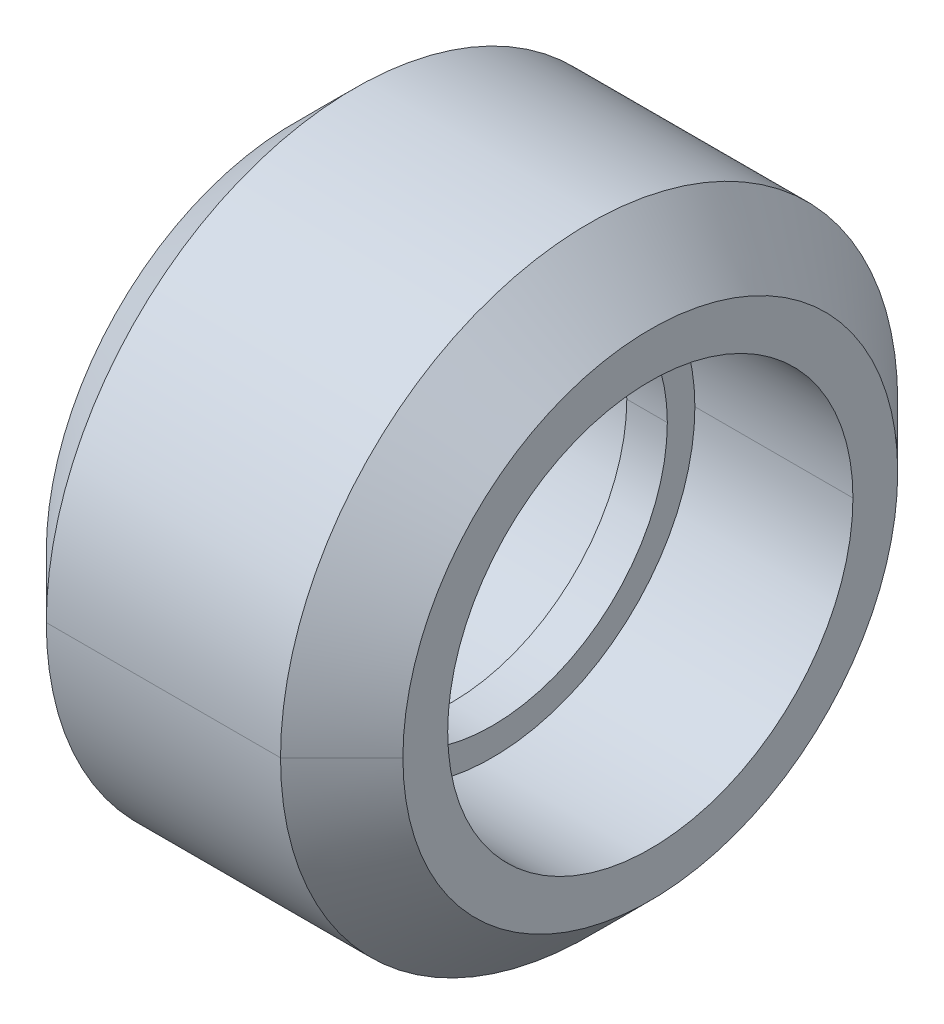
ISO-10303-21;
HEADER;
FILE_DESCRIPTION(('STEP AP214'),'2;1');
FILE_NAME('part.step','',(''),(''),'','','');
FILE_SCHEMA(('AUTOMOTIVE_DESIGN { 1 0 10303 214 1 1 1 1 }'));
ENDSEC;
DATA;
#1=APPLICATION_CONTEXT('core data for automotive mechanical design processes');
#2=APPLICATION_PROTOCOL_DEFINITION('international standard','automotive_design',2000,#1);
#3=PRODUCT_CONTEXT('',#1,'mechanical');
#4=PRODUCT('Part','Part','',(#3));
#5=PRODUCT_RELATED_PRODUCT_CATEGORY('part','',(#4));
#6=PRODUCT_DEFINITION_FORMATION('','',#4);
#7=PRODUCT_DEFINITION_CONTEXT('part definition',#1,'design');
#8=PRODUCT_DEFINITION('design','',#6,#7);
#9=PRODUCT_DEFINITION_SHAPE('','',#8);
#10=(LENGTH_UNIT() NAMED_UNIT(*) SI_UNIT(.MILLI.,.METRE.));
#11=(NAMED_UNIT(*) PLANE_ANGLE_UNIT() SI_UNIT($,.RADIAN.));
#12=(NAMED_UNIT(*) SI_UNIT($,.STERADIAN.) SOLID_ANGLE_UNIT());
#13=UNCERTAINTY_MEASURE_WITH_UNIT(LENGTH_MEASURE(1.E-05),#10,'distance_accuracy_value','');
#14=(GEOMETRIC_REPRESENTATION_CONTEXT(3) GLOBAL_UNCERTAINTY_ASSIGNED_CONTEXT((#13)) GLOBAL_UNIT_ASSIGNED_CONTEXT((#10,
#11,#12)) REPRESENTATION_CONTEXT('',''));
#15=CARTESIAN_POINT('',(0.,0.,0.));
#16=DIRECTION('',(0.,0.,1.));
#17=DIRECTION('',(1.,0.,0.));
#18=AXIS2_PLACEMENT_3D('',#15,#16,#17);
#19=CARTESIAN_POINT('',(0.,0.,0.));
#20=DIRECTION('',(1.,0.,0.));
#21=DIRECTION('',(0.,0.,-1.));
#22=AXIS2_PLACEMENT_3D('',#19,#20,#21);
#23=CYLINDRICAL_SURFACE('',#22,5.);
#24=DIRECTION('',(1.,0.,0.));
#25=VECTOR('',#24,1.);
#26=CARTESIAN_POINT('',(0.,0.,5.));
#27=LINE('',#26,#25);
#28=CARTESIAN_POINT('',(-4.4,0.,5.));
#29=VERTEX_POINT('',#28);
#30=CARTESIAN_POINT('',(-0.5,0.,5.));
#31=VERTEX_POINT('',#30);
#32=EDGE_CURVE('E21',#29,#31,#27,.T.);
#33=ORIENTED_EDGE('',*,*,#32,.F.);
#34=CARTESIAN_POINT('',(-4.4,0.,0.));
#35=DIRECTION('',(1.,0.,0.));
#36=DIRECTION('',(0.,0.,-1.));
#37=AXIS2_PLACEMENT_3D('',#34,#35,#36);
#38=CIRCLE('',#37,5.);
#39=CARTESIAN_POINT('',(-4.4,0.,-5.));
#40=VERTEX_POINT('',#39);
#41=EDGE_CURVE('E11',#40,#29,#38,.T.);
#42=ORIENTED_EDGE('',*,*,#41,.F.);
#43=DIRECTION('',(1.,0.,0.));
#44=VECTOR('',#43,1.);
#45=CARTESIAN_POINT('',(0.,0.,-5.));
#46=LINE('',#45,#44);
#47=CARTESIAN_POINT('',(-0.5,0.,-5.));
#48=VERTEX_POINT('',#47);
#49=EDGE_CURVE('E132',#40,#48,#46,.T.);
#50=ORIENTED_EDGE('',*,*,#49,.T.);
#51=CARTESIAN_POINT('',(-0.5,0.,0.));
#52=DIRECTION('',(1.,0.,0.));
#53=DIRECTION('',(0.,0.,-1.));
#54=AXIS2_PLACEMENT_3D('',#51,#52,#53);
#55=CIRCLE('',#54,5.);
#56=EDGE_CURVE('E125',#48,#31,#55,.T.);
#57=ORIENTED_EDGE('',*,*,#56,.T.);
#58=EDGE_LOOP('',(#33,#42,#50,#57));
#59=FACE_BOUND('',#58,.T.);
#60=ADVANCED_FACE('F17',(#59),#23,.F.);
#61=CARTESIAN_POINT('',(-4.4,5.,0.));
#62=DIRECTION('',(-1.,0.,0.));
#63=DIRECTION('',(0.,0.,1.));
#64=AXIS2_PLACEMENT_3D('',#61,#62,#63);
#65=PLANE('',#64);
#66=ORIENTED_EDGE('',*,*,#41,.T.);
#67=CARTESIAN_POINT('',(-4.4,0.,0.));
#68=DIRECTION('',(1.,0.,0.));
#69=DIRECTION('',(0.,0.,-1.));
#70=AXIS2_PLACEMENT_3D('',#67,#68,#69);
#71=CIRCLE('',#70,5.);
#72=EDGE_CURVE('E120',#29,#40,#71,.T.);
#73=ORIENTED_EDGE('',*,*,#72,.T.);
#74=EDGE_LOOP('',(#66,#73));
#75=FACE_BOUND('',#74,.T.);
#76=CARTESIAN_POINT('',(-4.4,0.,0.));
#77=DIRECTION('',(1.,0.,0.));
#78=DIRECTION('',(0.,0.,-1.));
#79=AXIS2_PLACEMENT_3D('',#76,#77,#78);
#80=CIRCLE('',#79,6.105);
#81=CARTESIAN_POINT('',(-4.4,0.,-6.105));
#82=VERTEX_POINT('',#81);
#83=CARTESIAN_POINT('',(-4.4,0.,6.105));
#84=VERTEX_POINT('',#83);
#85=EDGE_CURVE('E151',#82,#84,#80,.T.);
#86=ORIENTED_EDGE('',*,*,#85,.F.);
#87=CARTESIAN_POINT('',(-4.4,0.,0.));
#88=DIRECTION('',(1.,0.,0.));
#89=DIRECTION('',(0.,0.,-1.));
#90=AXIS2_PLACEMENT_3D('',#87,#88,#89);
#91=CIRCLE('',#90,6.105);
#92=EDGE_CURVE('E28',#84,#82,#91,.T.);
#93=ORIENTED_EDGE('',*,*,#92,.F.);
#94=EDGE_LOOP('',(#86,#93));
#95=FACE_BOUND('',#94,.T.);
#96=ADVANCED_FACE('F117',(#75,#95),#65,.T.);
#97=CARTESIAN_POINT('',(-2.89,0.,0.));
#98=DIRECTION('',(1.,0.,0.));
#99=DIRECTION('',(0.,0.,-1.));
#100=AXIS2_PLACEMENT_3D('',#97,#98,#99);
#101=CONICAL_SURFACE('',#100,7.615,0.785398163397447);
#102=DIRECTION('',(0.707106781186549,0.,0.707106781186546));
#103=VECTOR('',#102,1.);
#104=CARTESIAN_POINT('',(-2.89,0.,7.615));
#105=LINE('',#104,#103);
#106=CARTESIAN_POINT('',(-2.89,0.,7.615));
#107=VERTEX_POINT('',#106);
#108=EDGE_CURVE('E146',#84,#107,#105,.T.);
#109=ORIENTED_EDGE('',*,*,#108,.F.);
#110=ORIENTED_EDGE('',*,*,#92,.T.);
#111=DIRECTION('',(0.707106781186549,0.,-0.707106781186546));
#112=VECTOR('',#111,1.);
#113=CARTESIAN_POINT('',(-2.89,0.,-7.615));
#114=LINE('',#113,#112);
#115=CARTESIAN_POINT('',(-2.89,0.,-7.615));
#116=VERTEX_POINT('',#115);
#117=EDGE_CURVE('E233',#82,#116,#114,.T.);
#118=ORIENTED_EDGE('',*,*,#117,.T.);
#119=CARTESIAN_POINT('',(-2.89,0.,0.));
#120=DIRECTION('',(1.,0.,0.));
#121=DIRECTION('',(0.,0.,-1.));
#122=AXIS2_PLACEMENT_3D('',#119,#120,#121);
#123=CIRCLE('',#122,7.615);
#124=EDGE_CURVE('E172',#107,#116,#123,.T.);
#125=ORIENTED_EDGE('',*,*,#124,.F.);
#126=EDGE_LOOP('',(#109,#110,#118,#125));
#127=FACE_BOUND('',#126,.T.);
#128=ADVANCED_FACE('F254',(#127),#101,.T.);
#129=CARTESIAN_POINT('',(0.,0.,0.));
#130=DIRECTION('',(1.,0.,0.));
#131=DIRECTION('',(0.,0.,-1.));
#132=AXIS2_PLACEMENT_3D('',#129,#130,#131);
#133=CYLINDRICAL_SURFACE('',#132,7.615);
#134=DIRECTION('',(1.,0.,0.));
#135=VECTOR('',#134,1.);
#136=CARTESIAN_POINT('',(0.,0.,7.615));
#137=LINE('',#136,#135);
#138=CARTESIAN_POINT('',(2.89,0.,7.615));
#139=VERTEX_POINT('',#138);
#140=EDGE_CURVE('E157',#107,#139,#137,.T.);
#141=ORIENTED_EDGE('',*,*,#140,.F.);
#142=ORIENTED_EDGE('',*,*,#124,.T.);
#143=DIRECTION('',(1.,0.,0.));
#144=VECTOR('',#143,1.);
#145=CARTESIAN_POINT('',(0.,0.,-7.615));
#146=LINE('',#145,#144);
#147=CARTESIAN_POINT('',(2.89,0.,-7.615));
#148=VERTEX_POINT('',#147);
#149=EDGE_CURVE('E156',#116,#148,#146,.T.);
#150=ORIENTED_EDGE('',*,*,#149,.T.);
#151=CARTESIAN_POINT('',(2.89,0.,0.));
#152=DIRECTION('',(1.,0.,0.));
#153=DIRECTION('',(0.,0.,-1.));
#154=AXIS2_PLACEMENT_3D('',#151,#152,#153);
#155=CIRCLE('',#154,7.615);
#156=EDGE_CURVE('E161',#139,#148,#155,.T.);
#157=ORIENTED_EDGE('',*,*,#156,.F.);
#158=EDGE_LOOP('',(#141,#142,#150,#157));
#159=FACE_BOUND('',#158,.T.);
#160=ADVANCED_FACE('F264',(#159),#133,.T.);
#161=CARTESIAN_POINT('',(4.4,0.,0.));
#162=DIRECTION('',(-1.,0.,0.));
#163=DIRECTION('',(0.,0.,1.));
#164=AXIS2_PLACEMENT_3D('',#161,#162,#163);
#165=CONICAL_SURFACE('',#164,6.105,0.785398163397447);
#166=DIRECTION('',(-0.707106781186549,0.,-0.707106781186546));
#167=VECTOR('',#166,1.);
#168=CARTESIAN_POINT('',(4.4,0.,-6.105));
#169=LINE('',#168,#167);
#170=CARTESIAN_POINT('',(4.4,0.,-6.105));
#171=VERTEX_POINT('',#170);
#172=EDGE_CURVE('E182',#171,#148,#169,.T.);
#173=ORIENTED_EDGE('',*,*,#172,.F.);
#174=CARTESIAN_POINT('',(4.4,0.,0.));
#175=DIRECTION('',(1.,0.,0.));
#176=DIRECTION('',(0.,0.,-1.));
#177=AXIS2_PLACEMENT_3D('',#174,#175,#176);
#178=CIRCLE('',#177,6.105);
#179=CARTESIAN_POINT('',(4.4,0.,6.105));
#180=VERTEX_POINT('',#179);
#181=EDGE_CURVE('E158',#180,#171,#178,.T.);
#182=ORIENTED_EDGE('',*,*,#181,.F.);
#183=DIRECTION('',(-0.707106781186549,0.,0.707106781186546));
#184=VECTOR('',#183,1.);
#185=CARTESIAN_POINT('',(4.4,0.,6.105));
#186=LINE('',#185,#184);
#187=EDGE_CURVE('E181',#180,#139,#186,.T.);
#188=ORIENTED_EDGE('',*,*,#187,.T.);
#189=ORIENTED_EDGE('',*,*,#156,.T.);
#190=EDGE_LOOP('',(#173,#182,#188,#189));
#191=FACE_BOUND('',#190,.T.);
#192=ADVANCED_FACE('F268',(#191),#165,.T.);
#193=CARTESIAN_POINT('',(4.4,5.,0.));
#194=DIRECTION('',(1.,0.,0.));
#195=DIRECTION('',(0.,1.,0.));
#196=AXIS2_PLACEMENT_3D('',#193,#194,#195);
#197=PLANE('',#196);
#198=CARTESIAN_POINT('',(4.4,0.,0.));
#199=DIRECTION('',(1.,0.,0.));
#200=DIRECTION('',(0.,0.,-1.));
#201=AXIS2_PLACEMENT_3D('',#198,#199,#200);
#202=CIRCLE('',#201,5.);
#203=CARTESIAN_POINT('',(4.4,0.,-5.));
#204=VERTEX_POINT('',#203);
#205=CARTESIAN_POINT('',(4.4,0.,5.));
#206=VERTEX_POINT('',#205);
#207=EDGE_CURVE('E162',#204,#206,#202,.T.);
#208=ORIENTED_EDGE('',*,*,#207,.F.);
#209=CARTESIAN_POINT('',(4.4,0.,0.));
#210=DIRECTION('',(1.,0.,0.));
#211=DIRECTION('',(0.,0.,-1.));
#212=AXIS2_PLACEMENT_3D('',#209,#210,#211);
#213=CIRCLE('',#212,5.);
#214=EDGE_CURVE('E145',#206,#204,#213,.T.);
#215=ORIENTED_EDGE('',*,*,#214,.F.);
#216=EDGE_LOOP('',(#208,#215));
#217=FACE_BOUND('',#216,.T.);
#218=ORIENTED_EDGE('',*,*,#181,.T.);
#219=CARTESIAN_POINT('',(4.4,0.,0.));
#220=DIRECTION('',(1.,0.,0.));
#221=DIRECTION('',(0.,0.,-1.));
#222=AXIS2_PLACEMENT_3D('',#219,#220,#221);
#223=CIRCLE('',#222,6.105);
#224=EDGE_CURVE('E171',#171,#180,#223,.T.);
#225=ORIENTED_EDGE('',*,*,#224,.T.);
#226=EDGE_LOOP('',(#218,#225));
#227=FACE_BOUND('',#226,.T.);
#228=ADVANCED_FACE('F273',(#217,#227),#197,.T.);
#229=CARTESIAN_POINT('',(0.,0.,0.));
#230=DIRECTION('',(1.,0.,0.));
#231=DIRECTION('',(0.,0.,-1.));
#232=AXIS2_PLACEMENT_3D('',#229,#230,#231);
#233=CYLINDRICAL_SURFACE('',#232,5.);
#234=DIRECTION('',(1.,0.,0.));
#235=VECTOR('',#234,1.);
#236=CARTESIAN_POINT('',(0.,0.,5.));
#237=LINE('',#236,#235);
#238=CARTESIAN_POINT('',(0.5,0.,5.));
#239=VERTEX_POINT('',#238);
#240=EDGE_CURVE('E180',#239,#206,#237,.T.);
#241=ORIENTED_EDGE('',*,*,#240,.F.);
#242=CARTESIAN_POINT('',(0.5,0.,0.));
#243=DIRECTION('',(1.,0.,0.));
#244=DIRECTION('',(0.,0.,-1.));
#245=AXIS2_PLACEMENT_3D('',#242,#243,#244);
#246=CIRCLE('',#245,5.);
#247=CARTESIAN_POINT('',(0.5,0.,-5.));
#248=VERTEX_POINT('',#247);
#249=EDGE_CURVE('E186',#248,#239,#246,.T.);
#250=ORIENTED_EDGE('',*,*,#249,.F.);
#251=DIRECTION('',(1.,0.,0.));
#252=VECTOR('',#251,1.);
#253=CARTESIAN_POINT('',(0.,0.,-5.));
#254=LINE('',#253,#252);
#255=EDGE_CURVE('E140',#248,#204,#254,.T.);
#256=ORIENTED_EDGE('',*,*,#255,.T.);
#257=ORIENTED_EDGE('',*,*,#207,.T.);
#258=EDGE_LOOP('',(#241,#250,#256,#257));
#259=FACE_BOUND('',#258,.T.);
#260=ADVANCED_FACE('F275',(#259),#233,.F.);
#261=CARTESIAN_POINT('',(0.5,4.32,0.));
#262=DIRECTION('',(1.,0.,0.));
#263=DIRECTION('',(0.,1.,0.));
#264=AXIS2_PLACEMENT_3D('',#261,#262,#263);
#265=PLANE('',#264);
#266=CARTESIAN_POINT('',(0.5,0.,0.));
#267=DIRECTION('',(1.,0.,0.));
#268=DIRECTION('',(0.,0.,-1.));
#269=AXIS2_PLACEMENT_3D('',#266,#267,#268);
#270=CIRCLE('',#269,4.32);
#271=CARTESIAN_POINT('',(0.5,0.,-4.32));
#272=VERTEX_POINT('',#271);
#273=CARTESIAN_POINT('',(0.5,0.,4.32));
#274=VERTEX_POINT('',#273);
#275=EDGE_CURVE('E42',#272,#274,#270,.T.);
#276=ORIENTED_EDGE('',*,*,#275,.F.);
#277=CARTESIAN_POINT('',(0.5,0.,0.));
#278=DIRECTION('',(1.,0.,0.));
#279=DIRECTION('',(0.,0.,-1.));
#280=AXIS2_PLACEMENT_3D('',#277,#278,#279);
#281=CIRCLE('',#280,4.32);
#282=EDGE_CURVE('E195',#274,#272,#281,.T.);
#283=ORIENTED_EDGE('',*,*,#282,.F.);
#284=EDGE_LOOP('',(#276,#283));
#285=FACE_BOUND('',#284,.T.);
#286=ORIENTED_EDGE('',*,*,#249,.T.);
#287=CARTESIAN_POINT('',(0.5,0.,0.));
#288=DIRECTION('',(1.,0.,0.));
#289=DIRECTION('',(0.,0.,-1.));
#290=AXIS2_PLACEMENT_3D('',#287,#288,#289);
#291=CIRCLE('',#290,5.);
#292=EDGE_CURVE('E176',#239,#248,#291,.T.);
#293=ORIENTED_EDGE('',*,*,#292,.T.);
#294=EDGE_LOOP('',(#286,#293));
#295=FACE_BOUND('',#294,.T.);
#296=ADVANCED_FACE('F219',(#285,#295),#265,.T.);
#297=CARTESIAN_POINT('',(0.,0.,0.));
#298=DIRECTION('',(1.,0.,0.));
#299=DIRECTION('',(0.,0.,-1.));
#300=AXIS2_PLACEMENT_3D('',#297,#298,#299);
#301=CYLINDRICAL_SURFACE('',#300,4.32);
#302=DIRECTION('',(1.,0.,0.));
#303=VECTOR('',#302,1.);
#304=CARTESIAN_POINT('',(0.,0.,4.32));
#305=LINE('',#304,#303);
#306=CARTESIAN_POINT('',(-0.5,0.,4.32));
#307=VERTEX_POINT('',#306);
#308=EDGE_CURVE('E191',#307,#274,#305,.T.);
#309=ORIENTED_EDGE('',*,*,#308,.F.);
#310=CARTESIAN_POINT('',(-0.5,0.,0.));
#311=DIRECTION('',(1.,0.,0.));
#312=DIRECTION('',(0.,0.,-1.));
#313=AXIS2_PLACEMENT_3D('',#310,#311,#312);
#314=CIRCLE('',#313,4.32);
#315=CARTESIAN_POINT('',(-0.5,0.,-4.32));
#316=VERTEX_POINT('',#315);
#317=EDGE_CURVE('E163',#316,#307,#314,.T.);
#318=ORIENTED_EDGE('',*,*,#317,.F.);
#319=DIRECTION('',(1.,0.,0.));
#320=VECTOR('',#319,1.);
#321=CARTESIAN_POINT('',(0.,0.,-4.32));
#322=LINE('',#321,#320);
#323=EDGE_CURVE('E196',#316,#272,#322,.T.);
#324=ORIENTED_EDGE('',*,*,#323,.T.);
#325=ORIENTED_EDGE('',*,*,#275,.T.);
#326=EDGE_LOOP('',(#309,#318,#324,#325));
#327=FACE_BOUND('',#326,.T.);
#328=ADVANCED_FACE('F218',(#327),#301,.F.);
#329=CARTESIAN_POINT('',(-0.5,4.32,0.));
#330=DIRECTION('',(-1.,0.,0.));
#331=DIRECTION('',(0.,0.,1.));
#332=AXIS2_PLACEMENT_3D('',#329,#330,#331);
#333=PLANE('',#332);
#334=ORIENTED_EDGE('',*,*,#317,.T.);
#335=CARTESIAN_POINT('',(-0.5,0.,0.));
#336=DIRECTION('',(1.,0.,0.));
#337=DIRECTION('',(0.,0.,-1.));
#338=AXIS2_PLACEMENT_3D('',#335,#336,#337);
#339=CIRCLE('',#338,4.32);
#340=EDGE_CURVE('E144',#307,#316,#339,.T.);
#341=ORIENTED_EDGE('',*,*,#340,.T.);
#342=EDGE_LOOP('',(#334,#341));
#343=FACE_BOUND('',#342,.T.);
#344=ORIENTED_EDGE('',*,*,#56,.F.);
#345=CARTESIAN_POINT('',(-0.5,0.,0.));
#346=DIRECTION('',(1.,0.,0.));
#347=DIRECTION('',(0.,0.,-1.));
#348=AXIS2_PLACEMENT_3D('',#345,#346,#347);
#349=CIRCLE('',#348,5.);
#350=EDGE_CURVE('E130',#31,#48,#349,.T.);
#351=ORIENTED_EDGE('',*,*,#350,.F.);
#352=EDGE_LOOP('',(#344,#351));
#353=FACE_BOUND('',#352,.T.);
#354=ADVANCED_FACE('F210',(#343,#353),#333,.T.);
#355=CARTESIAN_POINT('',(0.,0.,0.));
#356=DIRECTION('',(1.,0.,0.));
#357=DIRECTION('',(0.,0.,-1.));
#358=AXIS2_PLACEMENT_3D('',#355,#356,#357);
#359=CYLINDRICAL_SURFACE('',#358,4.32);
#360=ORIENTED_EDGE('',*,*,#340,.F.);
#361=ORIENTED_EDGE('',*,*,#308,.T.);
#362=ORIENTED_EDGE('',*,*,#282,.T.);
#363=ORIENTED_EDGE('',*,*,#323,.F.);
#364=EDGE_LOOP('',(#360,#361,#362,#363));
#365=FACE_BOUND('',#364,.T.);
#366=ADVANCED_FACE('F215',(#365),#359,.F.);
#367=CARTESIAN_POINT('',(0.,0.,0.));
#368=DIRECTION('',(1.,0.,0.));
#369=DIRECTION('',(0.,0.,-1.));
#370=AXIS2_PLACEMENT_3D('',#367,#368,#369);
#371=CYLINDRICAL_SURFACE('',#370,5.);
#372=ORIENTED_EDGE('',*,*,#292,.F.);
#373=ORIENTED_EDGE('',*,*,#240,.T.);
#374=ORIENTED_EDGE('',*,*,#214,.T.);
#375=ORIENTED_EDGE('',*,*,#255,.F.);
#376=EDGE_LOOP('',(#372,#373,#374,#375));
#377=FACE_BOUND('',#376,.T.);
#378=ADVANCED_FACE('F19',(#377),#371,.F.);
#379=CARTESIAN_POINT('',(4.4,0.,0.));
#380=DIRECTION('',(-1.,0.,0.));
#381=DIRECTION('',(0.,0.,1.));
#382=AXIS2_PLACEMENT_3D('',#379,#380,#381);
#383=CONICAL_SURFACE('',#382,6.105,0.785398163397447);
#384=ORIENTED_EDGE('',*,*,#224,.F.);
#385=ORIENTED_EDGE('',*,*,#172,.T.);
#386=CARTESIAN_POINT('',(2.89,0.,0.));
#387=DIRECTION('',(1.,0.,0.));
#388=DIRECTION('',(0.,0.,-1.));
#389=AXIS2_PLACEMENT_3D('',#386,#387,#388);
#390=CIRCLE('',#389,7.615);
#391=EDGE_CURVE('E152',#148,#139,#390,.T.);
#392=ORIENTED_EDGE('',*,*,#391,.T.);
#393=ORIENTED_EDGE('',*,*,#187,.F.);
#394=EDGE_LOOP('',(#384,#385,#392,#393));
#395=FACE_BOUND('',#394,.T.);
#396=ADVANCED_FACE('F271',(#395),#383,.T.);
#397=CARTESIAN_POINT('',(0.,0.,0.));
#398=DIRECTION('',(1.,0.,0.));
#399=DIRECTION('',(0.,0.,-1.));
#400=AXIS2_PLACEMENT_3D('',#397,#398,#399);
#401=CYLINDRICAL_SURFACE('',#400,7.615);
#402=CARTESIAN_POINT('',(-2.89,0.,0.));
#403=DIRECTION('',(1.,0.,0.));
#404=DIRECTION('',(0.,0.,-1.));
#405=AXIS2_PLACEMENT_3D('',#402,#403,#404);
#406=CIRCLE('',#405,7.615);
#407=EDGE_CURVE('E150',#116,#107,#406,.T.);
#408=ORIENTED_EDGE('',*,*,#407,.T.);
#409=ORIENTED_EDGE('',*,*,#140,.T.);
#410=ORIENTED_EDGE('',*,*,#391,.F.);
#411=ORIENTED_EDGE('',*,*,#149,.F.);
#412=EDGE_LOOP('',(#408,#409,#410,#411));
#413=FACE_BOUND('',#412,.T.);
#414=ADVANCED_FACE('F261',(#413),#401,.T.);
#415=CARTESIAN_POINT('',(-2.89,0.,0.));
#416=DIRECTION('',(1.,0.,0.));
#417=DIRECTION('',(0.,0.,-1.));
#418=AXIS2_PLACEMENT_3D('',#415,#416,#417);
#419=CONICAL_SURFACE('',#418,7.615,0.785398163397447);
#420=ORIENTED_EDGE('',*,*,#85,.T.);
#421=ORIENTED_EDGE('',*,*,#108,.T.);
#422=ORIENTED_EDGE('',*,*,#407,.F.);
#423=ORIENTED_EDGE('',*,*,#117,.F.);
#424=EDGE_LOOP('',(#420,#421,#422,#423));
#425=FACE_BOUND('',#424,.T.);
#426=ADVANCED_FACE('F258',(#425),#419,.T.);
#427=CARTESIAN_POINT('',(0.,0.,0.));
#428=DIRECTION('',(1.,0.,0.));
#429=DIRECTION('',(0.,0.,-1.));
#430=AXIS2_PLACEMENT_3D('',#427,#428,#429);
#431=CYLINDRICAL_SURFACE('',#430,5.);
#432=ORIENTED_EDGE('',*,*,#72,.F.);
#433=ORIENTED_EDGE('',*,*,#32,.T.);
#434=ORIENTED_EDGE('',*,*,#350,.T.);
#435=ORIENTED_EDGE('',*,*,#49,.F.);
#436=EDGE_LOOP('',(#432,#433,#434,#435));
#437=FACE_BOUND('',#436,.T.);
#438=ADVANCED_FACE('F131',(#437),#431,.F.);
#439=CLOSED_SHELL('',(#60,#96,#128,#160,#192,#228,#260,#296,#328,#354,#366,#378,#396,#414,#426,#438));
#440=MANIFOLD_SOLID_BREP('B1',#439);
#441=ADVANCED_BREP_SHAPE_REPRESENTATION('',(#18,#440),#14);
#442=SHAPE_DEFINITION_REPRESENTATION(#9,#441);
ENDSEC;
END-ISO-10303-21;
